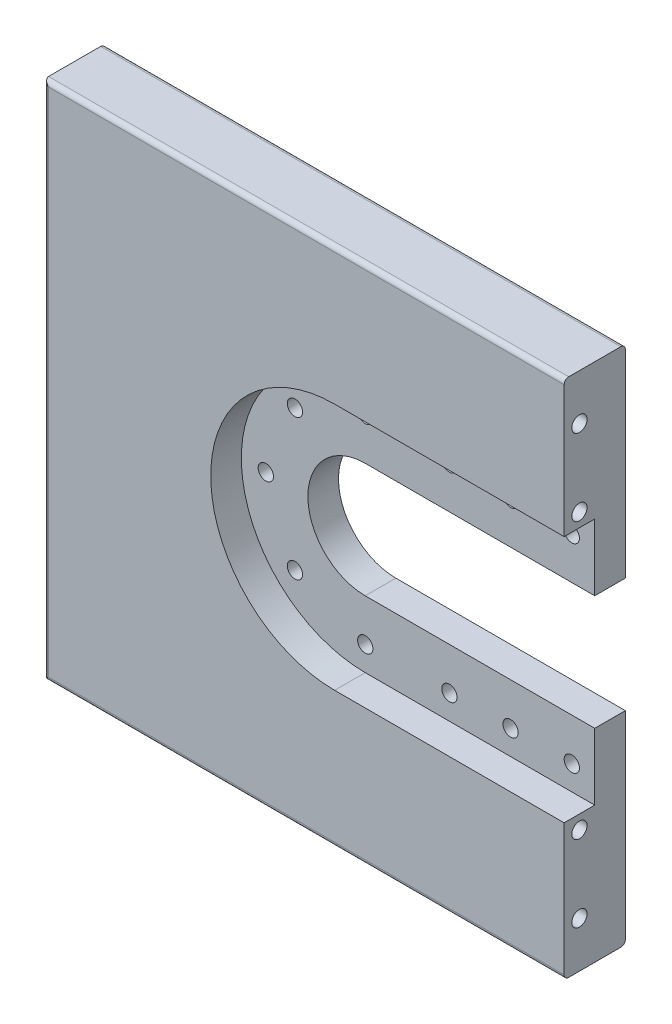
ISO-10303-21;
HEADER;
FILE_DESCRIPTION(('STEP AP214'),'2;1');
FILE_NAME('part.step','',(''),(''),'','','');
FILE_SCHEMA(('AUTOMOTIVE_DESIGN { 1 0 10303 214 1 1 1 1 }'));
ENDSEC;
DATA;
#1=APPLICATION_CONTEXT('core data for automotive mechanical design processes');
#2=APPLICATION_PROTOCOL_DEFINITION('international standard','automotive_design',2000,#1);
#3=PRODUCT_CONTEXT('',#1,'mechanical');
#4=PRODUCT('Part','Part','',(#3));
#5=PRODUCT_RELATED_PRODUCT_CATEGORY('part','',(#4));
#6=PRODUCT_DEFINITION_FORMATION('','',#4);
#7=PRODUCT_DEFINITION_CONTEXT('part definition',#1,'design');
#8=PRODUCT_DEFINITION('design','',#6,#7);
#9=PRODUCT_DEFINITION_SHAPE('','',#8);
#10=(LENGTH_UNIT() NAMED_UNIT(*) SI_UNIT(.MILLI.,.METRE.));
#11=(NAMED_UNIT(*) PLANE_ANGLE_UNIT() SI_UNIT($,.RADIAN.));
#12=(NAMED_UNIT(*) SI_UNIT($,.STERADIAN.) SOLID_ANGLE_UNIT());
#13=UNCERTAINTY_MEASURE_WITH_UNIT(LENGTH_MEASURE(1.E-05),#10,'distance_accuracy_value','');
#14=(GEOMETRIC_REPRESENTATION_CONTEXT(3) GLOBAL_UNCERTAINTY_ASSIGNED_CONTEXT((#13)) GLOBAL_UNIT_ASSIGNED_CONTEXT((#10,
#11,#12)) REPRESENTATION_CONTEXT('',''));
#15=CARTESIAN_POINT('',(0.,0.,0.));
#16=DIRECTION('',(0.,0.,1.));
#17=DIRECTION('',(1.,0.,0.));
#18=AXIS2_PLACEMENT_3D('',#15,#16,#17);
#19=CARTESIAN_POINT('',(170.,340.,-40.));
#20=DIRECTION('',(1.,0.,0.));
#21=DIRECTION('',(0.,1.,0.));
#22=AXIS2_PLACEMENT_3D('',#19,#20,#21);
#23=PLANE('',#22);
#24=CARTESIAN_POINT('',(170.,30.0000000000001,-10.0000000000024));
#25=DIRECTION('',(1.,0.,0.));
#26=DIRECTION('',(0.,1.,0.));
#27=AXIS2_PLACEMENT_3D('',#24,#25,#26);
#28=CIRCLE('',#27,5.);
#29=CARTESIAN_POINT('',(170.,35.0000000000001,-10.0000000000024));
#30=VERTEX_POINT('',#29);
#31=EDGE_CURVE('E599',#30,#30,#28,.T.);
#32=ORIENTED_EDGE('',*,*,#31,.F.);
#33=EDGE_LOOP('',(#32));
#34=FACE_BOUND('',#33,.T.);
#35=CARTESIAN_POINT('',(170.,80.0000000000001,-10.0000000000022));
#36=DIRECTION('',(1.,0.,0.));
#37=DIRECTION('',(0.,1.,0.));
#38=AXIS2_PLACEMENT_3D('',#35,#36,#37);
#39=CIRCLE('',#38,5.);
#40=CARTESIAN_POINT('',(170.,85.0000000000001,-10.0000000000022));
#41=VERTEX_POINT('',#40);
#42=EDGE_CURVE('E583',#41,#41,#39,.T.);
#43=ORIENTED_EDGE('',*,*,#42,.F.);
#44=EDGE_LOOP('',(#43));
#45=FACE_BOUND('',#44,.T.);
#46=DIRECTION('',(0.,1.,0.));
#47=VECTOR('',#46,1.);
#48=CARTESIAN_POINT('',(170.,340.,0.));
#49=LINE('',#48,#47);
#50=CARTESIAN_POINT('',(170.,3.,0.));
#51=VERTEX_POINT('',#50);
#52=CARTESIAN_POINT('',(170.,89.,0.));
#53=VERTEX_POINT('',#52);
#54=EDGE_CURVE('E244',#51,#53,#49,.T.);
#55=ORIENTED_EDGE('',*,*,#54,.F.);
#56=CARTESIAN_POINT('',(170.,3.,-3.));
#57=DIRECTION('',(1.,0.,0.));
#58=DIRECTION('',(0.,1.,0.));
#59=AXIS2_PLACEMENT_3D('',#56,#57,#58);
#60=CIRCLE('',#59,3.);
#61=CARTESIAN_POINT('',(170.,0.,-3.));
#62=VERTEX_POINT('',#61);
#63=EDGE_CURVE('E345',#51,#62,#60,.T.);
#64=ORIENTED_EDGE('',*,*,#63,.T.);
#65=DIRECTION('',(0.,0.,1.));
#66=VECTOR('',#65,1.);
#67=CARTESIAN_POINT('',(170.,0.,-40.));
#68=LINE('',#67,#66);
#69=CARTESIAN_POINT('',(170.,0.,-37.));
#70=VERTEX_POINT('',#69);
#71=EDGE_CURVE('E254',#70,#62,#68,.T.);
#72=ORIENTED_EDGE('',*,*,#71,.F.);
#73=CARTESIAN_POINT('',(170.,3.,-37.));
#74=DIRECTION('',(1.,0.,0.));
#75=DIRECTION('',(0.,1.,0.));
#76=AXIS2_PLACEMENT_3D('',#73,#74,#75);
#77=CIRCLE('',#76,3.);
#78=CARTESIAN_POINT('',(170.,3.,-40.));
#79=VERTEX_POINT('',#78);
#80=EDGE_CURVE('E342',#70,#79,#77,.T.);
#81=ORIENTED_EDGE('',*,*,#80,.T.);
#82=DIRECTION('',(0.,1.,0.));
#83=VECTOR('',#82,1.);
#84=CARTESIAN_POINT('',(170.,340.,-40.));
#85=LINE('',#84,#83);
#86=CARTESIAN_POINT('',(170.,132.5,-39.9999999999999));
#87=VERTEX_POINT('',#86);
#88=EDGE_CURVE('E240',#79,#87,#85,.T.);
#89=ORIENTED_EDGE('',*,*,#88,.T.);
#90=DIRECTION('',(0.,0.,-1.));
#91=VECTOR('',#90,1.);
#92=CARTESIAN_POINT('',(170.,132.5,100.));
#93=LINE('',#92,#91);
#94=CARTESIAN_POINT('',(170.,132.5,-20.));
#95=VERTEX_POINT('',#94);
#96=EDGE_CURVE('E166',#95,#87,#93,.T.);
#97=ORIENTED_EDGE('',*,*,#96,.F.);
#98=DIRECTION('',(0.,1.,0.));
#99=VECTOR('',#98,1.);
#100=CARTESIAN_POINT('',(170.,0.,-20.));
#101=LINE('',#100,#99);
#102=CARTESIAN_POINT('',(170.,89.,-20.));
#103=VERTEX_POINT('',#102);
#104=EDGE_CURVE('E209',#103,#95,#101,.T.);
#105=ORIENTED_EDGE('',*,*,#104,.F.);
#106=DIRECTION('',(0.,0.,1.));
#107=VECTOR('',#106,1.);
#108=CARTESIAN_POINT('',(170.,89.,-20.));
#109=LINE('',#108,#107);
#110=EDGE_CURVE('E227',#103,#53,#109,.T.);
#111=ORIENTED_EDGE('',*,*,#110,.T.);
#112=EDGE_LOOP('',(#55,#64,#72,#81,#89,#97,#105,#111));
#113=FACE_BOUND('',#112,.T.);
#114=ADVANCED_FACE('F38',(#34,#45,#113),#23,.T.);
#115=CARTESIAN_POINT('',(170.,260.,-10.));
#116=DIRECTION('',(1.,0.,0.));
#117=DIRECTION('',(0.,1.,0.));
#118=AXIS2_PLACEMENT_3D('',#115,#116,#117);
#119=CIRCLE('',#118,5.);
#120=CARTESIAN_POINT('',(170.,265.,-10.));
#121=VERTEX_POINT('',#120);
#122=EDGE_CURVE('E589',#121,#121,#119,.T.);
#123=ORIENTED_EDGE('',*,*,#122,.F.);
#124=EDGE_LOOP('',(#123));
#125=FACE_BOUND('',#124,.T.);
#126=CARTESIAN_POINT('',(170.,310.,-9.99999999999983));
#127=DIRECTION('',(1.,0.,0.));
#128=DIRECTION('',(0.,1.,0.));
#129=AXIS2_PLACEMENT_3D('',#126,#127,#128);
#130=CIRCLE('',#129,5.);
#131=CARTESIAN_POINT('',(170.,315.,-9.99999999999983));
#132=VERTEX_POINT('',#131);
#133=EDGE_CURVE('E580',#132,#132,#130,.T.);
#134=ORIENTED_EDGE('',*,*,#133,.F.);
#135=EDGE_LOOP('',(#134));
#136=FACE_BOUND('',#135,.T.);
#137=CARTESIAN_POINT('',(170.,207.5,-39.9999999999999));
#138=VERTEX_POINT('',#137);
#139=CARTESIAN_POINT('',(170.,337.,-40.));
#140=VERTEX_POINT('',#139);
#141=EDGE_CURVE('E180',#138,#140,#85,.T.);
#142=ORIENTED_EDGE('',*,*,#141,.T.);
#143=CARTESIAN_POINT('',(170.,337.,-37.));
#144=DIRECTION('',(1.,0.,0.));
#145=DIRECTION('',(0.,1.,0.));
#146=AXIS2_PLACEMENT_3D('',#143,#144,#145);
#147=CIRCLE('',#146,3.);
#148=CARTESIAN_POINT('',(170.,340.,-37.));
#149=VERTEX_POINT('',#148);
#150=EDGE_CURVE('E11',#140,#149,#147,.T.);
#151=ORIENTED_EDGE('',*,*,#150,.T.);
#152=DIRECTION('',(0.,0.,1.));
#153=VECTOR('',#152,1.);
#154=CARTESIAN_POINT('',(170.,340.,-40.));
#155=LINE('',#154,#153);
#156=CARTESIAN_POINT('',(170.,340.,-3.));
#157=VERTEX_POINT('',#156);
#158=EDGE_CURVE('E251',#149,#157,#155,.T.);
#159=ORIENTED_EDGE('',*,*,#158,.T.);
#160=CARTESIAN_POINT('',(170.,337.,-3.));
#161=DIRECTION('',(1.,0.,0.));
#162=DIRECTION('',(0.,1.,0.));
#163=AXIS2_PLACEMENT_3D('',#160,#161,#162);
#164=CIRCLE('',#163,3.);
#165=CARTESIAN_POINT('',(170.,337.,0.));
#166=VERTEX_POINT('',#165);
#167=EDGE_CURVE('E48',#157,#166,#164,.T.);
#168=ORIENTED_EDGE('',*,*,#167,.T.);
#169=CARTESIAN_POINT('',(170.,251.,0.));
#170=VERTEX_POINT('',#169);
#171=EDGE_CURVE('E231',#170,#166,#49,.T.);
#172=ORIENTED_EDGE('',*,*,#171,.F.);
#173=DIRECTION('',(0.,0.,1.));
#174=VECTOR('',#173,1.);
#175=CARTESIAN_POINT('',(170.,251.,-20.));
#176=LINE('',#175,#174);
#177=CARTESIAN_POINT('',(170.,251.,-20.));
#178=VERTEX_POINT('',#177);
#179=EDGE_CURVE('E216',#178,#170,#176,.T.);
#180=ORIENTED_EDGE('',*,*,#179,.F.);
#181=DIRECTION('',(0.,-1.,0.));
#182=VECTOR('',#181,1.);
#183=CARTESIAN_POINT('',(170.,0.,-20.));
#184=LINE('',#183,#182);
#185=CARTESIAN_POINT('',(170.,207.5,-20.));
#186=VERTEX_POINT('',#185);
#187=EDGE_CURVE('E195',#178,#186,#184,.T.);
#188=ORIENTED_EDGE('',*,*,#187,.T.);
#189=DIRECTION('',(0.,0.,-1.));
#190=VECTOR('',#189,1.);
#191=CARTESIAN_POINT('',(170.,207.5,100.));
#192=LINE('',#191,#190);
#193=EDGE_CURVE('E175',#186,#138,#192,.T.);
#194=ORIENTED_EDGE('',*,*,#193,.T.);
#195=EDGE_LOOP('',(#142,#151,#159,#168,#172,#180,#188,#194));
#196=FACE_BOUND('',#195,.T.);
#197=ADVANCED_FACE('F384',(#125,#136,#196),#23,.T.);
#198=CARTESIAN_POINT('',(0.,0.,0.));
#199=DIRECTION('',(0.,0.,-1.));
#200=DIRECTION('',(-1.,0.,0.));
#201=AXIS2_PLACEMENT_3D('',#198,#199,#200);
#202=PLANE('',#201);
#203=DIRECTION('',(0.,-1.,0.));
#204=VECTOR('',#203,1.);
#205=CARTESIAN_POINT('',(-167.,0.,0.));
#206=LINE('',#205,#204);
#207=CARTESIAN_POINT('',(-167.,337.,0.));
#208=VERTEX_POINT('',#207);
#209=CARTESIAN_POINT('',(-167.,3.,0.));
#210=VERTEX_POINT('',#209);
#211=EDGE_CURVE('E335',#208,#210,#206,.T.);
#212=ORIENTED_EDGE('',*,*,#211,.T.);
#213=DIRECTION('',(1.,0.,0.));
#214=VECTOR('',#213,1.);
#215=CARTESIAN_POINT('',(170.,3.,0.));
#216=LINE('',#215,#214);
#217=EDGE_CURVE('E339',#210,#51,#216,.T.);
#218=ORIENTED_EDGE('',*,*,#217,.T.);
#219=ORIENTED_EDGE('',*,*,#54,.T.);
#220=DIRECTION('',(-1.,0.,0.));
#221=VECTOR('',#220,1.);
#222=CARTESIAN_POINT('',(0.,89.,0.));
#223=LINE('',#222,#221);
#224=CARTESIAN_POINT('',(20.,89.,0.));
#225=VERTEX_POINT('',#224);
#226=EDGE_CURVE('E192',#53,#225,#223,.T.);
#227=ORIENTED_EDGE('',*,*,#226,.T.);
#228=CARTESIAN_POINT('',(20.,170.,0.));
#229=DIRECTION('',(0.,0.,1.));
#230=DIRECTION('',(1.,0.,0.));
#231=AXIS2_PLACEMENT_3D('',#228,#229,#230);
#232=CIRCLE('',#231,81.0000000000001);
#233=CARTESIAN_POINT('',(20.,251.,0.));
#234=VERTEX_POINT('',#233);
#235=EDGE_CURVE('E220',#234,#225,#232,.T.);
#236=ORIENTED_EDGE('',*,*,#235,.F.);
#237=DIRECTION('',(1.,0.,0.));
#238=VECTOR('',#237,1.);
#239=CARTESIAN_POINT('',(0.,251.,0.));
#240=LINE('',#239,#238);
#241=EDGE_CURVE('E185',#234,#170,#240,.T.);
#242=ORIENTED_EDGE('',*,*,#241,.T.);
#243=ORIENTED_EDGE('',*,*,#171,.T.);
#244=DIRECTION('',(-1.,0.,0.));
#245=VECTOR('',#244,1.);
#246=CARTESIAN_POINT('',(-170.,337.,0.));
#247=LINE('',#246,#245);
#248=EDGE_CURVE('E332',#166,#208,#247,.T.);
#249=ORIENTED_EDGE('',*,*,#248,.T.);
#250=EDGE_LOOP('',(#212,#218,#219,#227,#236,#242,#243,#249));
#251=FACE_BOUND('',#250,.T.);
#252=ADVANCED_FACE('F387',(#251),#202,.F.);
#253=CARTESIAN_POINT('',(-170.,0.,-40.));
#254=DIRECTION('',(-1.,0.,0.));
#255=DIRECTION('',(0.,-1.,0.));
#256=AXIS2_PLACEMENT_3D('',#253,#254,#255);
#257=PLANE('',#256);
#258=DIRECTION('',(0.,0.,1.));
#259=VECTOR('',#258,1.);
#260=CARTESIAN_POINT('',(-170.,340.,-40.));
#261=LINE('',#260,#259);
#262=CARTESIAN_POINT('',(-170.,340.,-37.));
#263=VERTEX_POINT('',#262);
#264=CARTESIAN_POINT('',(-170.,340.,-3.));
#265=VERTEX_POINT('',#264);
#266=EDGE_CURVE('E247',#263,#265,#261,.T.);
#267=ORIENTED_EDGE('',*,*,#266,.F.);
#268=DIRECTION('',(0.,-1.,0.));
#269=VECTOR('',#268,1.);
#270=CARTESIAN_POINT('',(-170.,0.,-37.));
#271=LINE('',#270,#269);
#272=CARTESIAN_POINT('',(-170.,0.,-37.));
#273=VERTEX_POINT('',#272);
#274=EDGE_CURVE('E319',#263,#273,#271,.T.);
#275=ORIENTED_EDGE('',*,*,#274,.T.);
#276=DIRECTION('',(0.,0.,1.));
#277=VECTOR('',#276,1.);
#278=CARTESIAN_POINT('',(-170.,0.,-40.));
#279=LINE('',#278,#277);
#280=CARTESIAN_POINT('',(-170.,0.,-3.));
#281=VERTEX_POINT('',#280);
#282=EDGE_CURVE('E243',#273,#281,#279,.T.);
#283=ORIENTED_EDGE('',*,*,#282,.T.);
#284=DIRECTION('',(0.,-1.,0.));
#285=VECTOR('',#284,1.);
#286=CARTESIAN_POINT('',(-170.,340.,-3.));
#287=LINE('',#286,#285);
#288=EDGE_CURVE('E250',#281,#265,#287,.F.);
#289=ORIENTED_EDGE('',*,*,#288,.T.);
#290=EDGE_LOOP('',(#267,#275,#283,#289));
#291=FACE_BOUND('',#290,.T.);
#292=ADVANCED_FACE('F401',(#291),#257,.T.);
#293=CARTESIAN_POINT('',(-170.,340.,-40.));
#294=DIRECTION('',(0.,1.,0.));
#295=DIRECTION('',(-1.,0.,0.));
#296=AXIS2_PLACEMENT_3D('',#293,#294,#295);
#297=PLANE('',#296);
#298=ORIENTED_EDGE('',*,*,#158,.F.);
#299=DIRECTION('',(-1.,0.,0.));
#300=VECTOR('',#299,1.);
#301=CARTESIAN_POINT('',(-170.,340.,-37.));
#302=LINE('',#301,#300);
#303=EDGE_CURVE('E356',#149,#263,#302,.T.);
#304=ORIENTED_EDGE('',*,*,#303,.T.);
#305=ORIENTED_EDGE('',*,*,#266,.T.);
#306=DIRECTION('',(-1.,0.,0.));
#307=VECTOR('',#306,1.);
#308=CARTESIAN_POINT('',(170.,340.,-3.));
#309=LINE('',#308,#307);
#310=EDGE_CURVE('E56',#265,#157,#309,.F.);
#311=ORIENTED_EDGE('',*,*,#310,.T.);
#312=EDGE_LOOP('',(#298,#304,#305,#311));
#313=FACE_BOUND('',#312,.T.);
#314=ADVANCED_FACE('F399',(#313),#297,.T.);
#315=CARTESIAN_POINT('',(170.,0.,-40.));
#316=DIRECTION('',(0.,-1.,0.));
#317=DIRECTION('',(0.,0.,-1.));
#318=AXIS2_PLACEMENT_3D('',#315,#316,#317);
#319=PLANE('',#318);
#320=ORIENTED_EDGE('',*,*,#71,.T.);
#321=DIRECTION('',(1.,0.,0.));
#322=VECTOR('',#321,1.);
#323=CARTESIAN_POINT('',(-170.,0.,-3.));
#324=LINE('',#323,#322);
#325=EDGE_CURVE('E351',#62,#281,#324,.F.);
#326=ORIENTED_EDGE('',*,*,#325,.T.);
#327=ORIENTED_EDGE('',*,*,#282,.F.);
#328=DIRECTION('',(1.,0.,0.));
#329=VECTOR('',#328,1.);
#330=CARTESIAN_POINT('',(170.,0.,-37.));
#331=LINE('',#330,#329);
#332=EDGE_CURVE('E348',#273,#70,#331,.T.);
#333=ORIENTED_EDGE('',*,*,#332,.T.);
#334=EDGE_LOOP('',(#320,#326,#327,#333));
#335=FACE_BOUND('',#334,.T.);
#336=ADVANCED_FACE('F404',(#335),#319,.T.);
#337=CARTESIAN_POINT('',(0.,0.,-40.));
#338=DIRECTION('',(0.,0.,-1.));
#339=DIRECTION('',(-1.,0.,0.));
#340=AXIS2_PLACEMENT_3D('',#337,#338,#339);
#341=PLANE('',#340);
#342=CARTESIAN_POINT('',(75.0000000000014,105.,-40.));
#343=DIRECTION('',(0.,0.,-1.));
#344=DIRECTION('',(-1.,0.,0.));
#345=AXIS2_PLACEMENT_3D('',#342,#343,#344);
#346=CIRCLE('',#345,4.99999999999999);
#347=CARTESIAN_POINT('',(70.0000000000015,105.,-40.));
#348=VERTEX_POINT('',#347);
#349=EDGE_CURVE('E316',#348,#348,#346,.F.);
#350=ORIENTED_EDGE('',*,*,#349,.T.);
#351=EDGE_LOOP('',(#350));
#352=FACE_BOUND('',#351,.T.);
#353=CARTESIAN_POINT('',(20.0000000000015,105.,-40.));
#354=DIRECTION('',(0.,0.,-1.));
#355=DIRECTION('',(-1.,0.,0.));
#356=AXIS2_PLACEMENT_3D('',#353,#354,#355);
#357=CIRCLE('',#356,5.);
#358=CARTESIAN_POINT('',(15.0000000000015,105.,-40.));
#359=VERTEX_POINT('',#358);
#360=EDGE_CURVE('E311',#359,#359,#357,.F.);
#361=ORIENTED_EDGE('',*,*,#360,.T.);
#362=EDGE_LOOP('',(#361));
#363=FACE_BOUND('',#362,.T.);
#364=CARTESIAN_POINT('',(-25.9619407771253,124.038059222874,-40.));
#365=DIRECTION('',(0.,0.,-1.));
#366=DIRECTION('',(-1.,0.,0.));
#367=AXIS2_PLACEMENT_3D('',#364,#365,#366);
#368=CIRCLE('',#367,4.99999999998577);
#369=CARTESIAN_POINT('',(-30.9619407771111,124.038059222874,-40.));
#370=VERTEX_POINT('',#369);
#371=EDGE_CURVE('E306',#370,#370,#368,.F.);
#372=ORIENTED_EDGE('',*,*,#371,.T.);
#373=EDGE_LOOP('',(#372));
#374=FACE_BOUND('',#373,.T.);
#375=CARTESIAN_POINT('',(155.,235.,-40.));
#376=DIRECTION('',(0.,0.,-1.));
#377=DIRECTION('',(-1.,0.,0.));
#378=AXIS2_PLACEMENT_3D('',#375,#376,#377);
#379=CIRCLE('',#378,5.00000000000002);
#380=CARTESIAN_POINT('',(150.,235.,-40.));
#381=VERTEX_POINT('',#380);
#382=EDGE_CURVE('E301',#381,#381,#379,.F.);
#383=ORIENTED_EDGE('',*,*,#382,.T.);
#384=EDGE_LOOP('',(#383));
#385=FACE_BOUND('',#384,.T.);
#386=CARTESIAN_POINT('',(20.0000000000001,235.,-40.));
#387=DIRECTION('',(0.,0.,-1.));
#388=DIRECTION('',(-1.,0.,0.));
#389=AXIS2_PLACEMENT_3D('',#386,#387,#388);
#390=CIRCLE('',#389,5.);
#391=CARTESIAN_POINT('',(15.0000000000001,235.,-40.));
#392=VERTEX_POINT('',#391);
#393=EDGE_CURVE('E296',#392,#392,#390,.F.);
#394=ORIENTED_EDGE('',*,*,#393,.T.);
#395=EDGE_LOOP('',(#394));
#396=FACE_BOUND('',#395,.T.);
#397=CARTESIAN_POINT('',(75.0000000000001,235.,-40.));
#398=DIRECTION('',(0.,0.,-1.));
#399=DIRECTION('',(-1.,0.,0.));
#400=AXIS2_PLACEMENT_3D('',#397,#398,#399);
#401=CIRCLE('',#400,5.00000000000001);
#402=CARTESIAN_POINT('',(70.0000000000001,235.,-40.));
#403=VERTEX_POINT('',#402);
#404=EDGE_CURVE('E291',#403,#403,#401,.F.);
#405=ORIENTED_EDGE('',*,*,#404,.T.);
#406=EDGE_LOOP('',(#405));
#407=FACE_BOUND('',#406,.T.);
#408=CARTESIAN_POINT('',(-45.,170.,-40.));
#409=DIRECTION('',(0.,0.,-1.));
#410=DIRECTION('',(-1.,0.,0.));
#411=AXIS2_PLACEMENT_3D('',#408,#409,#410);
#412=CIRCLE('',#411,4.99999999999033);
#413=CARTESIAN_POINT('',(-49.9999999999903,170.,-40.));
#414=VERTEX_POINT('',#413);
#415=EDGE_CURVE('E286',#414,#414,#412,.F.);
#416=ORIENTED_EDGE('',*,*,#415,.T.);
#417=EDGE_LOOP('',(#416));
#418=FACE_BOUND('',#417,.T.);
#419=CARTESIAN_POINT('',(115.,235.,-40.));
#420=DIRECTION('',(0.,0.,-1.));
#421=DIRECTION('',(-1.,0.,0.));
#422=AXIS2_PLACEMENT_3D('',#419,#420,#421);
#423=CIRCLE('',#422,4.99999999999999);
#424=CARTESIAN_POINT('',(110.,235.,-40.));
#425=VERTEX_POINT('',#424);
#426=EDGE_CURVE('E281',#425,#425,#423,.F.);
#427=ORIENTED_EDGE('',*,*,#426,.T.);
#428=EDGE_LOOP('',(#427));
#429=FACE_BOUND('',#428,.T.);
#430=CARTESIAN_POINT('',(115.000000000001,105.,-40.));
#431=DIRECTION('',(0.,0.,-1.));
#432=DIRECTION('',(-1.,0.,0.));
#433=AXIS2_PLACEMENT_3D('',#430,#431,#432);
#434=CIRCLE('',#433,5.00000000000001);
#435=CARTESIAN_POINT('',(110.000000000001,105.,-40.));
#436=VERTEX_POINT('',#435);
#437=EDGE_CURVE('E276',#436,#436,#434,.F.);
#438=ORIENTED_EDGE('',*,*,#437,.T.);
#439=EDGE_LOOP('',(#438));
#440=FACE_BOUND('',#439,.T.);
#441=CARTESIAN_POINT('',(155.000000000001,105.,-40.));
#442=DIRECTION('',(0.,0.,-1.));
#443=DIRECTION('',(-1.,0.,0.));
#444=AXIS2_PLACEMENT_3D('',#441,#442,#443);
#445=CIRCLE('',#444,4.99999999999999);
#446=CARTESIAN_POINT('',(150.000000000001,105.,-40.));
#447=VERTEX_POINT('',#446);
#448=EDGE_CURVE('E271',#447,#447,#445,.F.);
#449=ORIENTED_EDGE('',*,*,#448,.T.);
#450=EDGE_LOOP('',(#449));
#451=FACE_BOUND('',#450,.T.);
#452=CARTESIAN_POINT('',(-25.9619407771257,215.961940777126,-40.));
#453=DIRECTION('',(0.,0.,-1.));
#454=DIRECTION('',(-1.,0.,0.));
#455=AXIS2_PLACEMENT_3D('',#452,#453,#454);
#456=CIRCLE('',#455,4.99999999999635);
#457=CARTESIAN_POINT('',(-30.9619407771221,215.961940777126,-40.));
#458=VERTEX_POINT('',#457);
#459=EDGE_CURVE('E265',#458,#458,#456,.F.);
#460=ORIENTED_EDGE('',*,*,#459,.T.);
#461=EDGE_LOOP('',(#460));
#462=FACE_BOUND('',#461,.T.);
#463=ORIENTED_EDGE('',*,*,#88,.F.);
#464=DIRECTION('',(1.,0.,0.));
#465=VECTOR('',#464,1.);
#466=CARTESIAN_POINT('',(0.,3.,-40.));
#467=LINE('',#466,#465);
#468=CARTESIAN_POINT('',(-167.,3.,-40.));
#469=VERTEX_POINT('',#468);
#470=EDGE_CURVE('E329',#79,#469,#467,.F.);
#471=ORIENTED_EDGE('',*,*,#470,.T.);
#472=DIRECTION('',(0.,-1.,0.));
#473=VECTOR('',#472,1.);
#474=CARTESIAN_POINT('',(-167.,0.,-40.));
#475=LINE('',#474,#473);
#476=CARTESIAN_POINT('',(-167.,337.,-40.));
#477=VERTEX_POINT('',#476);
#478=EDGE_CURVE('E326',#469,#477,#475,.F.);
#479=ORIENTED_EDGE('',*,*,#478,.T.);
#480=DIRECTION('',(-1.,0.,0.));
#481=VECTOR('',#480,1.);
#482=CARTESIAN_POINT('',(-1.10042693911376E-13,337.,-40.));
#483=LINE('',#482,#481);
#484=EDGE_CURVE('E323',#477,#140,#483,.F.);
#485=ORIENTED_EDGE('',*,*,#484,.T.);
#486=ORIENTED_EDGE('',*,*,#141,.F.);
#487=DIRECTION('',(-1.,0.,0.));
#488=VECTOR('',#487,1.);
#489=CARTESIAN_POINT('',(0.,207.5,-40.));
#490=LINE('',#489,#488);
#491=CARTESIAN_POINT('',(20.,207.5,-39.9999999999999));
#492=VERTEX_POINT('',#491);
#493=EDGE_CURVE('E165',#138,#492,#490,.T.);
#494=ORIENTED_EDGE('',*,*,#493,.T.);
#495=CARTESIAN_POINT('',(20.,170.,-40.));
#496=DIRECTION('',(0.,0.,-1.));
#497=DIRECTION('',(-1.,0.,0.));
#498=AXIS2_PLACEMENT_3D('',#495,#496,#497);
#499=CIRCLE('',#498,37.5);
#500=CARTESIAN_POINT('',(20.,132.5,-39.9999999999999));
#501=VERTEX_POINT('',#500);
#502=EDGE_CURVE('E154',#492,#501,#499,.F.);
#503=ORIENTED_EDGE('',*,*,#502,.T.);
#504=DIRECTION('',(1.,0.,0.));
#505=VECTOR('',#504,1.);
#506=CARTESIAN_POINT('',(0.,132.5,-40.));
#507=LINE('',#506,#505);
#508=EDGE_CURVE('E182',#501,#87,#507,.T.);
#509=ORIENTED_EDGE('',*,*,#508,.T.);
#510=EDGE_LOOP('',(#463,#471,#479,#485,#486,#494,#503,#509));
#511=FACE_BOUND('',#510,.T.);
#512=ADVANCED_FACE('F179',(#352,#363,#374,#385,#396,#407,#418,#429,#440,#451,#462,#511),#341,.T.);
#513=CARTESIAN_POINT('',(0.,89.,-20.));
#514=DIRECTION('',(0.,1.,0.));
#515=DIRECTION('',(-1.,0.,0.));
#516=AXIS2_PLACEMENT_3D('',#513,#514,#515);
#517=PLANE('',#516);
#518=ORIENTED_EDGE('',*,*,#226,.F.);
#519=ORIENTED_EDGE('',*,*,#110,.F.);
#520=DIRECTION('',(-1.,0.,0.));
#521=VECTOR('',#520,1.);
#522=CARTESIAN_POINT('',(0.,89.,-20.));
#523=LINE('',#522,#521);
#524=CARTESIAN_POINT('',(20.,89.,-20.));
#525=VERTEX_POINT('',#524);
#526=EDGE_CURVE('E206',#103,#525,#523,.T.);
#527=ORIENTED_EDGE('',*,*,#526,.T.);
#528=DIRECTION('',(0.,0.,1.));
#529=VECTOR('',#528,1.);
#530=CARTESIAN_POINT('',(20.,89.,-20.));
#531=LINE('',#530,#529);
#532=EDGE_CURVE('E232',#525,#225,#531,.T.);
#533=ORIENTED_EDGE('',*,*,#532,.T.);
#534=EDGE_LOOP('',(#518,#519,#527,#533));
#535=FACE_BOUND('',#534,.T.);
#536=ADVANCED_FACE('F418',(#535),#517,.T.);
#537=CARTESIAN_POINT('',(20.,170.,-20.));
#538=DIRECTION('',(0.,0.,1.));
#539=DIRECTION('',(1.,0.,0.));
#540=AXIS2_PLACEMENT_3D('',#537,#538,#539);
#541=CYLINDRICAL_SURFACE('',#540,81.0000000000001);
#542=ORIENTED_EDGE('',*,*,#235,.T.);
#543=ORIENTED_EDGE('',*,*,#532,.F.);
#544=CARTESIAN_POINT('',(20.,170.,-20.));
#545=DIRECTION('',(0.,0.,1.));
#546=DIRECTION('',(1.,0.,0.));
#547=AXIS2_PLACEMENT_3D('',#544,#545,#546);
#548=CIRCLE('',#547,81.0000000000001);
#549=CARTESIAN_POINT('',(20.,251.,-20.));
#550=VERTEX_POINT('',#549);
#551=EDGE_CURVE('E202',#550,#525,#548,.T.);
#552=ORIENTED_EDGE('',*,*,#551,.F.);
#553=DIRECTION('',(0.,0.,1.));
#554=VECTOR('',#553,1.);
#555=CARTESIAN_POINT('',(20.,251.,-20.));
#556=LINE('',#555,#554);
#557=EDGE_CURVE('E235',#550,#234,#556,.T.);
#558=ORIENTED_EDGE('',*,*,#557,.T.);
#559=EDGE_LOOP('',(#542,#543,#552,#558));
#560=FACE_BOUND('',#559,.T.);
#561=ADVANCED_FACE('F427',(#560),#541,.F.);
#562=CARTESIAN_POINT('',(0.,251.,-20.));
#563=DIRECTION('',(0.,-1.,0.));
#564=DIRECTION('',(0.,0.,-1.));
#565=AXIS2_PLACEMENT_3D('',#562,#563,#564);
#566=PLANE('',#565);
#567=ORIENTED_EDGE('',*,*,#241,.F.);
#568=ORIENTED_EDGE('',*,*,#557,.F.);
#569=DIRECTION('',(1.,0.,0.));
#570=VECTOR('',#569,1.);
#571=CARTESIAN_POINT('',(0.,251.,-20.));
#572=LINE('',#571,#570);
#573=EDGE_CURVE('E199',#550,#178,#572,.T.);
#574=ORIENTED_EDGE('',*,*,#573,.T.);
#575=ORIENTED_EDGE('',*,*,#179,.T.);
#576=EDGE_LOOP('',(#567,#568,#574,#575));
#577=FACE_BOUND('',#576,.T.);
#578=ADVANCED_FACE('F429',(#577),#566,.T.);
#579=CARTESIAN_POINT('',(0.,0.,-20.));
#580=DIRECTION('',(0.,0.,1.));
#581=DIRECTION('',(1.,0.,0.));
#582=AXIS2_PLACEMENT_3D('',#579,#580,#581);
#583=PLANE('',#582);
#584=CARTESIAN_POINT('',(75.0000000000014,105.,-20.));
#585=DIRECTION('',(0.,0.,1.));
#586=DIRECTION('',(1.,0.,0.));
#587=AXIS2_PLACEMENT_3D('',#584,#585,#586);
#588=CIRCLE('',#587,4.99999999999999);
#589=CARTESIAN_POINT('',(80.0000000000014,105.,-20.));
#590=VERTEX_POINT('',#589);
#591=EDGE_CURVE('E312',#590,#590,#588,.F.);
#592=ORIENTED_EDGE('',*,*,#591,.T.);
#593=EDGE_LOOP('',(#592));
#594=FACE_BOUND('',#593,.T.);
#595=CARTESIAN_POINT('',(20.0000000000015,105.,-20.));
#596=DIRECTION('',(0.,0.,1.));
#597=DIRECTION('',(1.,0.,0.));
#598=AXIS2_PLACEMENT_3D('',#595,#596,#597);
#599=CIRCLE('',#598,5.);
#600=CARTESIAN_POINT('',(25.0000000000015,105.,-20.));
#601=VERTEX_POINT('',#600);
#602=EDGE_CURVE('E307',#601,#601,#599,.F.);
#603=ORIENTED_EDGE('',*,*,#602,.T.);
#604=EDGE_LOOP('',(#603));
#605=FACE_BOUND('',#604,.T.);
#606=CARTESIAN_POINT('',(-25.9619407771253,124.038059222874,-20.));
#607=DIRECTION('',(0.,0.,1.));
#608=DIRECTION('',(1.,0.,0.));
#609=AXIS2_PLACEMENT_3D('',#606,#607,#608);
#610=CIRCLE('',#609,4.99999999998577);
#611=CARTESIAN_POINT('',(-20.9619407771395,124.038059222874,-20.));
#612=VERTEX_POINT('',#611);
#613=EDGE_CURVE('E302',#612,#612,#610,.F.);
#614=ORIENTED_EDGE('',*,*,#613,.T.);
#615=EDGE_LOOP('',(#614));
#616=FACE_BOUND('',#615,.T.);
#617=CARTESIAN_POINT('',(155.,235.,-20.));
#618=DIRECTION('',(0.,0.,1.));
#619=DIRECTION('',(1.,0.,0.));
#620=AXIS2_PLACEMENT_3D('',#617,#618,#619);
#621=CIRCLE('',#620,5.00000000000002);
#622=CARTESIAN_POINT('',(160.,235.,-20.));
#623=VERTEX_POINT('',#622);
#624=EDGE_CURVE('E297',#623,#623,#621,.F.);
#625=ORIENTED_EDGE('',*,*,#624,.T.);
#626=EDGE_LOOP('',(#625));
#627=FACE_BOUND('',#626,.T.);
#628=CARTESIAN_POINT('',(20.0000000000001,235.,-20.));
#629=DIRECTION('',(0.,0.,1.));
#630=DIRECTION('',(1.,0.,0.));
#631=AXIS2_PLACEMENT_3D('',#628,#629,#630);
#632=CIRCLE('',#631,5.);
#633=CARTESIAN_POINT('',(25.0000000000001,235.,-20.));
#634=VERTEX_POINT('',#633);
#635=EDGE_CURVE('E292',#634,#634,#632,.F.);
#636=ORIENTED_EDGE('',*,*,#635,.T.);
#637=EDGE_LOOP('',(#636));
#638=FACE_BOUND('',#637,.T.);
#639=CARTESIAN_POINT('',(75.0000000000001,235.,-20.));
#640=DIRECTION('',(0.,0.,1.));
#641=DIRECTION('',(1.,0.,0.));
#642=AXIS2_PLACEMENT_3D('',#639,#640,#641);
#643=CIRCLE('',#642,5.00000000000001);
#644=CARTESIAN_POINT('',(80.0000000000001,235.,-20.));
#645=VERTEX_POINT('',#644);
#646=EDGE_CURVE('E287',#645,#645,#643,.F.);
#647=ORIENTED_EDGE('',*,*,#646,.T.);
#648=EDGE_LOOP('',(#647));
#649=FACE_BOUND('',#648,.T.);
#650=CARTESIAN_POINT('',(-45.,170.,-20.));
#651=DIRECTION('',(0.,0.,1.));
#652=DIRECTION('',(1.,0.,0.));
#653=AXIS2_PLACEMENT_3D('',#650,#651,#652);
#654=CIRCLE('',#653,4.99999999999033);
#655=CARTESIAN_POINT('',(-40.0000000000097,170.,-20.));
#656=VERTEX_POINT('',#655);
#657=EDGE_CURVE('E282',#656,#656,#654,.F.);
#658=ORIENTED_EDGE('',*,*,#657,.T.);
#659=EDGE_LOOP('',(#658));
#660=FACE_BOUND('',#659,.T.);
#661=CARTESIAN_POINT('',(115.,235.,-20.));
#662=DIRECTION('',(0.,0.,1.));
#663=DIRECTION('',(1.,0.,0.));
#664=AXIS2_PLACEMENT_3D('',#661,#662,#663);
#665=CIRCLE('',#664,4.99999999999999);
#666=CARTESIAN_POINT('',(120.,235.,-20.));
#667=VERTEX_POINT('',#666);
#668=EDGE_CURVE('E277',#667,#667,#665,.F.);
#669=ORIENTED_EDGE('',*,*,#668,.T.);
#670=EDGE_LOOP('',(#669));
#671=FACE_BOUND('',#670,.T.);
#672=CARTESIAN_POINT('',(115.000000000001,105.,-20.));
#673=DIRECTION('',(0.,0.,1.));
#674=DIRECTION('',(1.,0.,0.));
#675=AXIS2_PLACEMENT_3D('',#672,#673,#674);
#676=CIRCLE('',#675,5.00000000000001);
#677=CARTESIAN_POINT('',(120.000000000001,105.,-20.));
#678=VERTEX_POINT('',#677);
#679=EDGE_CURVE('E272',#678,#678,#676,.F.);
#680=ORIENTED_EDGE('',*,*,#679,.T.);
#681=EDGE_LOOP('',(#680));
#682=FACE_BOUND('',#681,.T.);
#683=CARTESIAN_POINT('',(155.000000000001,105.,-20.));
#684=DIRECTION('',(0.,0.,1.));
#685=DIRECTION('',(1.,0.,0.));
#686=AXIS2_PLACEMENT_3D('',#683,#684,#685);
#687=CIRCLE('',#686,4.99999999999999);
#688=CARTESIAN_POINT('',(160.000000000001,105.,-20.));
#689=VERTEX_POINT('',#688);
#690=EDGE_CURVE('E267',#689,#689,#687,.F.);
#691=ORIENTED_EDGE('',*,*,#690,.T.);
#692=EDGE_LOOP('',(#691));
#693=FACE_BOUND('',#692,.T.);
#694=CARTESIAN_POINT('',(-25.9619407771257,215.961940777126,-20.));
#695=DIRECTION('',(0.,0.,1.));
#696=DIRECTION('',(1.,0.,0.));
#697=AXIS2_PLACEMENT_3D('',#694,#695,#696);
#698=CIRCLE('',#697,4.99999999999635);
#699=CARTESIAN_POINT('',(-20.9619407771294,215.961940777126,-20.));
#700=VERTEX_POINT('',#699);
#701=EDGE_CURVE('E261',#700,#700,#698,.F.);
#702=ORIENTED_EDGE('',*,*,#701,.T.);
#703=EDGE_LOOP('',(#702));
#704=FACE_BOUND('',#703,.T.);
#705=CARTESIAN_POINT('',(20.,170.,-20.));
#706=DIRECTION('',(0.,0.,1.));
#707=DIRECTION('',(1.,0.,0.));
#708=AXIS2_PLACEMENT_3D('',#705,#706,#707);
#709=CIRCLE('',#708,37.5);
#710=CARTESIAN_POINT('',(20.,207.5,-20.));
#711=VERTEX_POINT('',#710);
#712=CARTESIAN_POINT('',(20.,132.5,-20.));
#713=VERTEX_POINT('',#712);
#714=EDGE_CURVE('E189',#711,#713,#709,.T.);
#715=ORIENTED_EDGE('',*,*,#714,.F.);
#716=DIRECTION('',(1.,0.,0.));
#717=VECTOR('',#716,1.);
#718=CARTESIAN_POINT('',(0.,207.5,-20.));
#719=LINE('',#718,#717);
#720=EDGE_CURVE('E172',#711,#186,#719,.T.);
#721=ORIENTED_EDGE('',*,*,#720,.T.);
#722=ORIENTED_EDGE('',*,*,#187,.F.);
#723=ORIENTED_EDGE('',*,*,#573,.F.);
#724=ORIENTED_EDGE('',*,*,#551,.T.);
#725=ORIENTED_EDGE('',*,*,#526,.F.);
#726=ORIENTED_EDGE('',*,*,#104,.T.);
#727=DIRECTION('',(1.,0.,0.));
#728=VECTOR('',#727,1.);
#729=CARTESIAN_POINT('',(0.,132.5,-20.));
#730=LINE('',#729,#728);
#731=EDGE_CURVE('E213',#713,#95,#730,.T.);
#732=ORIENTED_EDGE('',*,*,#731,.F.);
#733=EDGE_LOOP('',(#715,#721,#722,#723,#724,#725,#726,#732));
#734=FACE_BOUND('',#733,.T.);
#735=ADVANCED_FACE('F421',(#594,#605,#616,#627,#638,#649,#660,#671,#682,#693,#704,#734),#583,.T.);
#736=CARTESIAN_POINT('',(20.,132.5,100.));
#737=DIRECTION('',(0.,1.,0.));
#738=DIRECTION('',(0.,0.,1.));
#739=AXIS2_PLACEMENT_3D('',#736,#737,#738);
#740=PLANE('',#739);
#741=DIRECTION('',(0.,0.,-1.));
#742=VECTOR('',#741,1.);
#743=CARTESIAN_POINT('',(20.,132.5,100.));
#744=LINE('',#743,#742);
#745=EDGE_CURVE('E160',#713,#501,#744,.T.);
#746=ORIENTED_EDGE('',*,*,#745,.F.);
#747=ORIENTED_EDGE('',*,*,#731,.T.);
#748=ORIENTED_EDGE('',*,*,#96,.T.);
#749=ORIENTED_EDGE('',*,*,#508,.F.);
#750=EDGE_LOOP('',(#746,#747,#748,#749));
#751=FACE_BOUND('',#750,.T.);
#752=ADVANCED_FACE('F431',(#751),#740,.T.);
#753=CARTESIAN_POINT('',(20.,207.5,100.));
#754=DIRECTION('',(0.,-1.,0.));
#755=DIRECTION('',(0.,0.,-1.));
#756=AXIS2_PLACEMENT_3D('',#753,#754,#755);
#757=PLANE('',#756);
#758=ORIENTED_EDGE('',*,*,#193,.F.);
#759=ORIENTED_EDGE('',*,*,#720,.F.);
#760=DIRECTION('',(0.,0.,-1.));
#761=VECTOR('',#760,1.);
#762=CARTESIAN_POINT('',(20.,207.5,100.));
#763=LINE('',#762,#761);
#764=EDGE_CURVE('E157',#711,#492,#763,.T.);
#765=ORIENTED_EDGE('',*,*,#764,.T.);
#766=ORIENTED_EDGE('',*,*,#493,.F.);
#767=EDGE_LOOP('',(#758,#759,#765,#766));
#768=FACE_BOUND('',#767,.T.);
#769=ADVANCED_FACE('F169',(#768),#757,.T.);
#770=CARTESIAN_POINT('',(20.,170.,100.));
#771=DIRECTION('',(0.,0.,-1.));
#772=DIRECTION('',(-1.,0.,0.));
#773=AXIS2_PLACEMENT_3D('',#770,#771,#772);
#774=CYLINDRICAL_SURFACE('',#773,37.5);
#775=ORIENTED_EDGE('',*,*,#764,.F.);
#776=ORIENTED_EDGE('',*,*,#714,.T.);
#777=ORIENTED_EDGE('',*,*,#745,.T.);
#778=ORIENTED_EDGE('',*,*,#502,.F.);
#779=EDGE_LOOP('',(#775,#776,#777,#778));
#780=FACE_BOUND('',#779,.T.);
#781=ADVANCED_FACE('F156',(#780),#774,.F.);
#782=CARTESIAN_POINT('',(-25.9619407771257,215.961940777126,363.));
#783=DIRECTION('',(0.,0.,-1.));
#784=DIRECTION('',(-1.,0.,0.));
#785=AXIS2_PLACEMENT_3D('',#782,#783,#784);
#786=CYLINDRICAL_SURFACE('',#785,4.99999999999635);
#787=ORIENTED_EDGE('',*,*,#459,.F.);
#788=EDGE_LOOP('',(#787));
#789=FACE_BOUND('',#788,.T.);
#790=ORIENTED_EDGE('',*,*,#701,.F.);
#791=EDGE_LOOP('',(#790));
#792=FACE_BOUND('',#791,.T.);
#793=ADVANCED_FACE('F497',(#789,#792),#786,.F.);
#794=CARTESIAN_POINT('',(155.000000000001,105.,363.));
#795=DIRECTION('',(0.,0.,-1.));
#796=DIRECTION('',(-1.,0.,0.));
#797=AXIS2_PLACEMENT_3D('',#794,#795,#796);
#798=CYLINDRICAL_SURFACE('',#797,4.99999999999999);
#799=ORIENTED_EDGE('',*,*,#448,.F.);
#800=EDGE_LOOP('',(#799));
#801=FACE_BOUND('',#800,.T.);
#802=ORIENTED_EDGE('',*,*,#690,.F.);
#803=EDGE_LOOP('',(#802));
#804=FACE_BOUND('',#803,.T.);
#805=ADVANCED_FACE('F500',(#801,#804),#798,.F.);
#806=CARTESIAN_POINT('',(115.000000000001,105.,363.));
#807=DIRECTION('',(0.,0.,-1.));
#808=DIRECTION('',(-1.,0.,0.));
#809=AXIS2_PLACEMENT_3D('',#806,#807,#808);
#810=CYLINDRICAL_SURFACE('',#809,5.00000000000001);
#811=ORIENTED_EDGE('',*,*,#437,.F.);
#812=EDGE_LOOP('',(#811));
#813=FACE_BOUND('',#812,.T.);
#814=ORIENTED_EDGE('',*,*,#679,.F.);
#815=EDGE_LOOP('',(#814));
#816=FACE_BOUND('',#815,.T.);
#817=ADVANCED_FACE('F515',(#813,#816),#810,.F.);
#818=CARTESIAN_POINT('',(115.,235.,363.));
#819=DIRECTION('',(0.,0.,-1.));
#820=DIRECTION('',(-1.,0.,0.));
#821=AXIS2_PLACEMENT_3D('',#818,#819,#820);
#822=CYLINDRICAL_SURFACE('',#821,4.99999999999999);
#823=ORIENTED_EDGE('',*,*,#426,.F.);
#824=EDGE_LOOP('',(#823));
#825=FACE_BOUND('',#824,.T.);
#826=ORIENTED_EDGE('',*,*,#668,.F.);
#827=EDGE_LOOP('',(#826));
#828=FACE_BOUND('',#827,.T.);
#829=ADVANCED_FACE('F512',(#825,#828),#822,.F.);
#830=CARTESIAN_POINT('',(-45.,170.,363.));
#831=DIRECTION('',(0.,0.,-1.));
#832=DIRECTION('',(-1.,0.,0.));
#833=AXIS2_PLACEMENT_3D('',#830,#831,#832);
#834=CYLINDRICAL_SURFACE('',#833,4.99999999999033);
#835=ORIENTED_EDGE('',*,*,#415,.F.);
#836=EDGE_LOOP('',(#835));
#837=FACE_BOUND('',#836,.T.);
#838=ORIENTED_EDGE('',*,*,#657,.F.);
#839=EDGE_LOOP('',(#838));
#840=FACE_BOUND('',#839,.T.);
#841=ADVANCED_FACE('F506',(#837,#840),#834,.F.);
#842=CARTESIAN_POINT('',(75.0000000000001,235.,363.));
#843=DIRECTION('',(0.,0.,-1.));
#844=DIRECTION('',(-1.,0.,0.));
#845=AXIS2_PLACEMENT_3D('',#842,#843,#844);
#846=CYLINDRICAL_SURFACE('',#845,5.00000000000001);
#847=ORIENTED_EDGE('',*,*,#404,.F.);
#848=EDGE_LOOP('',(#847));
#849=FACE_BOUND('',#848,.T.);
#850=ORIENTED_EDGE('',*,*,#646,.F.);
#851=EDGE_LOOP('',(#850));
#852=FACE_BOUND('',#851,.T.);
#853=ADVANCED_FACE('F502',(#849,#852),#846,.F.);
#854=CARTESIAN_POINT('',(20.0000000000001,235.,363.));
#855=DIRECTION('',(0.,0.,-1.));
#856=DIRECTION('',(-1.,0.,0.));
#857=AXIS2_PLACEMENT_3D('',#854,#855,#856);
#858=CYLINDRICAL_SURFACE('',#857,5.);
#859=ORIENTED_EDGE('',*,*,#393,.F.);
#860=EDGE_LOOP('',(#859));
#861=FACE_BOUND('',#860,.T.);
#862=ORIENTED_EDGE('',*,*,#635,.F.);
#863=EDGE_LOOP('',(#862));
#864=FACE_BOUND('',#863,.T.);
#865=ADVANCED_FACE('F505',(#861,#864),#858,.F.);
#866=CARTESIAN_POINT('',(155.,235.,363.));
#867=DIRECTION('',(0.,0.,-1.));
#868=DIRECTION('',(-1.,0.,0.));
#869=AXIS2_PLACEMENT_3D('',#866,#867,#868);
#870=CYLINDRICAL_SURFACE('',#869,5.00000000000002);
#871=ORIENTED_EDGE('',*,*,#382,.F.);
#872=EDGE_LOOP('',(#871));
#873=FACE_BOUND('',#872,.T.);
#874=ORIENTED_EDGE('',*,*,#624,.F.);
#875=EDGE_LOOP('',(#874));
#876=FACE_BOUND('',#875,.T.);
#877=ADVANCED_FACE('F510',(#873,#876),#870,.F.);
#878=CARTESIAN_POINT('',(-25.9619407771253,124.038059222874,363.));
#879=DIRECTION('',(0.,0.,-1.));
#880=DIRECTION('',(-1.,0.,0.));
#881=AXIS2_PLACEMENT_3D('',#878,#879,#880);
#882=CYLINDRICAL_SURFACE('',#881,4.99999999998577);
#883=ORIENTED_EDGE('',*,*,#371,.F.);
#884=EDGE_LOOP('',(#883));
#885=FACE_BOUND('',#884,.T.);
#886=ORIENTED_EDGE('',*,*,#613,.F.);
#887=EDGE_LOOP('',(#886));
#888=FACE_BOUND('',#887,.T.);
#889=ADVANCED_FACE('F528',(#885,#888),#882,.F.);
#890=CARTESIAN_POINT('',(20.0000000000015,105.,363.));
#891=DIRECTION('',(0.,0.,-1.));
#892=DIRECTION('',(-1.,0.,0.));
#893=AXIS2_PLACEMENT_3D('',#890,#891,#892);
#894=CYLINDRICAL_SURFACE('',#893,5.);
#895=ORIENTED_EDGE('',*,*,#360,.F.);
#896=EDGE_LOOP('',(#895));
#897=FACE_BOUND('',#896,.T.);
#898=ORIENTED_EDGE('',*,*,#602,.F.);
#899=EDGE_LOOP('',(#898));
#900=FACE_BOUND('',#899,.T.);
#901=ADVANCED_FACE('F524',(#897,#900),#894,.F.);
#902=CARTESIAN_POINT('',(75.0000000000014,105.,363.));
#903=DIRECTION('',(0.,0.,-1.));
#904=DIRECTION('',(-1.,0.,0.));
#905=AXIS2_PLACEMENT_3D('',#902,#903,#904);
#906=CYLINDRICAL_SURFACE('',#905,4.99999999999999);
#907=ORIENTED_EDGE('',*,*,#349,.F.);
#908=EDGE_LOOP('',(#907));
#909=FACE_BOUND('',#908,.T.);
#910=ORIENTED_EDGE('',*,*,#591,.F.);
#911=EDGE_LOOP('',(#910));
#912=FACE_BOUND('',#911,.T.);
#913=ADVANCED_FACE('F520',(#909,#912),#906,.F.);
#914=CARTESIAN_POINT('',(152.,310.,-9.99999999999983));
#915=DIRECTION('',(1.,0.,0.));
#916=DIRECTION('',(0.,1.,0.));
#917=AXIS2_PLACEMENT_3D('',#914,#915,#916);
#918=CYLINDRICAL_SURFACE('',#917,5.);
#919=CARTESIAN_POINT('',(152.,310.,-9.99999999999983));
#920=DIRECTION('',(1.,0.,0.));
#921=DIRECTION('',(0.,1.,0.));
#922=AXIS2_PLACEMENT_3D('',#919,#920,#921);
#923=CIRCLE('',#922,5.);
#924=CARTESIAN_POINT('',(152.,315.,-9.99999999999983));
#925=VERTEX_POINT('',#924);
#926=EDGE_CURVE('E577',#925,#925,#923,.T.);
#927=ORIENTED_EDGE('',*,*,#926,.F.);
#928=EDGE_LOOP('',(#927));
#929=FACE_BOUND('',#928,.T.);
#930=ORIENTED_EDGE('',*,*,#133,.T.);
#931=EDGE_LOOP('',(#930));
#932=FACE_BOUND('',#931,.T.);
#933=ADVANCED_FACE('F523',(#929,#932),#918,.F.);
#934=CARTESIAN_POINT('',(152.,310.,-9.99999999999983));
#935=DIRECTION('',(1.,0.,0.));
#936=DIRECTION('',(0.,1.,0.));
#937=AXIS2_PLACEMENT_3D('',#934,#935,#936);
#938=PLANE('',#937);
#939=ORIENTED_EDGE('',*,*,#926,.T.);
#940=EDGE_LOOP('',(#939));
#941=FACE_BOUND('',#940,.T.);
#942=ADVANCED_FACE('F565',(#941),#938,.T.);
#943=CARTESIAN_POINT('',(152.,260.,-10.));
#944=DIRECTION('',(1.,0.,0.));
#945=DIRECTION('',(0.,1.,0.));
#946=AXIS2_PLACEMENT_3D('',#943,#944,#945);
#947=CYLINDRICAL_SURFACE('',#946,5.);
#948=CARTESIAN_POINT('',(152.,260.,-10.));
#949=DIRECTION('',(1.,0.,0.));
#950=DIRECTION('',(0.,1.,0.));
#951=AXIS2_PLACEMENT_3D('',#948,#949,#950);
#952=CIRCLE('',#951,5.);
#953=CARTESIAN_POINT('',(152.,265.,-10.));
#954=VERTEX_POINT('',#953);
#955=EDGE_CURVE('E595',#954,#954,#952,.T.);
#956=ORIENTED_EDGE('',*,*,#955,.F.);
#957=EDGE_LOOP('',(#956));
#958=FACE_BOUND('',#957,.T.);
#959=ORIENTED_EDGE('',*,*,#122,.T.);
#960=EDGE_LOOP('',(#959));
#961=FACE_BOUND('',#960,.T.);
#962=ADVANCED_FACE('F561',(#958,#961),#947,.F.);
#963=CARTESIAN_POINT('',(152.,260.,-10.));
#964=DIRECTION('',(1.,0.,0.));
#965=DIRECTION('',(0.,1.,0.));
#966=AXIS2_PLACEMENT_3D('',#963,#964,#965);
#967=PLANE('',#966);
#968=ORIENTED_EDGE('',*,*,#955,.T.);
#969=EDGE_LOOP('',(#968));
#970=FACE_BOUND('',#969,.T.);
#971=ADVANCED_FACE('F546',(#970),#967,.T.);
#972=CARTESIAN_POINT('',(152.,80.0000000000001,-10.0000000000022));
#973=DIRECTION('',(1.,0.,0.));
#974=DIRECTION('',(0.,1.,0.));
#975=AXIS2_PLACEMENT_3D('',#972,#973,#974);
#976=CYLINDRICAL_SURFACE('',#975,5.);
#977=CARTESIAN_POINT('',(152.,80.0000000000001,-10.0000000000022));
#978=DIRECTION('',(1.,0.,0.));
#979=DIRECTION('',(0.,1.,0.));
#980=AXIS2_PLACEMENT_3D('',#977,#978,#979);
#981=CIRCLE('',#980,5.);
#982=CARTESIAN_POINT('',(152.,85.0000000000001,-10.0000000000022));
#983=VERTEX_POINT('',#982);
#984=EDGE_CURVE('E266',#983,#983,#981,.T.);
#985=ORIENTED_EDGE('',*,*,#984,.F.);
#986=EDGE_LOOP('',(#985));
#987=FACE_BOUND('',#986,.T.);
#988=ORIENTED_EDGE('',*,*,#42,.T.);
#989=EDGE_LOOP('',(#988));
#990=FACE_BOUND('',#989,.T.);
#991=ADVANCED_FACE('F542',(#987,#990),#976,.F.);
#992=CARTESIAN_POINT('',(152.,0.,0.));
#993=DIRECTION('',(1.,0.,0.));
#994=DIRECTION('',(0.,1.,0.));
#995=AXIS2_PLACEMENT_3D('',#992,#993,#994);
#996=PLANE('',#995);
#997=ORIENTED_EDGE('',*,*,#984,.T.);
#998=EDGE_LOOP('',(#997));
#999=FACE_BOUND('',#998,.T.);
#1000=ADVANCED_FACE('F545',(#999),#996,.T.);
#1001=CARTESIAN_POINT('',(152.,30.0000000000001,-10.0000000000024));
#1002=DIRECTION('',(1.,0.,0.));
#1003=DIRECTION('',(0.,1.,0.));
#1004=AXIS2_PLACEMENT_3D('',#1001,#1002,#1003);
#1005=CYLINDRICAL_SURFACE('',#1004,5.);
#1006=CARTESIAN_POINT('',(152.,30.0000000000001,-10.0000000000024));
#1007=DIRECTION('',(1.,0.,0.));
#1008=DIRECTION('',(0.,1.,0.));
#1009=AXIS2_PLACEMENT_3D('',#1006,#1007,#1008);
#1010=CIRCLE('',#1009,5.);
#1011=CARTESIAN_POINT('',(152.,35.0000000000001,-10.0000000000024));
#1012=VERTEX_POINT('',#1011);
#1013=EDGE_CURVE('E367',#1012,#1012,#1010,.T.);
#1014=ORIENTED_EDGE('',*,*,#1013,.F.);
#1015=EDGE_LOOP('',(#1014));
#1016=FACE_BOUND('',#1015,.T.);
#1017=ORIENTED_EDGE('',*,*,#31,.T.);
#1018=EDGE_LOOP('',(#1017));
#1019=FACE_BOUND('',#1018,.T.);
#1020=ADVANCED_FACE('F550',(#1016,#1019),#1005,.F.);
#1021=CARTESIAN_POINT('',(152.,30.0000000000001,-10.0000000000024));
#1022=DIRECTION('',(1.,0.,0.));
#1023=DIRECTION('',(0.,1.,0.));
#1024=AXIS2_PLACEMENT_3D('',#1021,#1022,#1023);
#1025=PLANE('',#1024);
#1026=ORIENTED_EDGE('',*,*,#1013,.T.);
#1027=EDGE_LOOP('',(#1026));
#1028=FACE_BOUND('',#1027,.T.);
#1029=ADVANCED_FACE('F552',(#1028),#1025,.T.);
#1030=CARTESIAN_POINT('',(-170.,337.,-37.));
#1031=DIRECTION('',(-1.,0.,0.));
#1032=DIRECTION('',(0.,-1.,0.));
#1033=AXIS2_PLACEMENT_3D('',#1030,#1031,#1032);
#1034=CYLINDRICAL_SURFACE('',#1033,3.);
#1035=ORIENTED_EDGE('',*,*,#150,.F.);
#1036=ORIENTED_EDGE('',*,*,#484,.F.);
#1037=CARTESIAN_POINT('',(-167.,337.,-37.));
#1038=DIRECTION('',(-0.707106781186547,-0.707106781186548,0.));
#1039=DIRECTION('',(-0.707106781186548,0.707106781186547,0.));
#1040=AXIS2_PLACEMENT_3D('',#1037,#1038,#1039);
#1041=ELLIPSE('',#1040,4.24264068711928,3.);
#1042=EDGE_CURVE('E364',#263,#477,#1041,.T.);
#1043=ORIENTED_EDGE('',*,*,#1042,.F.);
#1044=ORIENTED_EDGE('',*,*,#303,.F.);
#1045=EDGE_LOOP('',(#1035,#1036,#1043,#1044));
#1046=FACE_BOUND('',#1045,.T.);
#1047=ADVANCED_FACE('F395',(#1046),#1034,.T.);
#1048=CARTESIAN_POINT('',(170.,3.,-37.));
#1049=DIRECTION('',(1.,0.,0.));
#1050=DIRECTION('',(0.,0.,-1.));
#1051=AXIS2_PLACEMENT_3D('',#1048,#1049,#1050);
#1052=CYLINDRICAL_SURFACE('',#1051,3.);
#1053=ORIENTED_EDGE('',*,*,#80,.F.);
#1054=ORIENTED_EDGE('',*,*,#332,.F.);
#1055=CARTESIAN_POINT('',(-167.,3.,-37.));
#1056=DIRECTION('',(0.707106781186548,-0.707106781186547,0.));
#1057=DIRECTION('',(0.707106781186547,0.707106781186548,0.));
#1058=AXIS2_PLACEMENT_3D('',#1055,#1056,#1057);
#1059=ELLIPSE('',#1058,4.24264068711928,3.);
#1060=EDGE_CURVE('E361',#469,#273,#1059,.F.);
#1061=ORIENTED_EDGE('',*,*,#1060,.F.);
#1062=ORIENTED_EDGE('',*,*,#470,.F.);
#1063=EDGE_LOOP('',(#1053,#1054,#1061,#1062));
#1064=FACE_BOUND('',#1063,.T.);
#1065=ADVANCED_FACE('F447',(#1064),#1052,.T.);
#1066=CARTESIAN_POINT('',(-167.,0.,-37.));
#1067=DIRECTION('',(0.,-1.,0.));
#1068=DIRECTION('',(1.,0.,0.));
#1069=AXIS2_PLACEMENT_3D('',#1066,#1067,#1068);
#1070=CYLINDRICAL_SURFACE('',#1069,3.);
#1071=ORIENTED_EDGE('',*,*,#1042,.T.);
#1072=ORIENTED_EDGE('',*,*,#478,.F.);
#1073=ORIENTED_EDGE('',*,*,#1060,.T.);
#1074=ORIENTED_EDGE('',*,*,#274,.F.);
#1075=EDGE_LOOP('',(#1071,#1072,#1073,#1074));
#1076=FACE_BOUND('',#1075,.T.);
#1077=ADVANCED_FACE('F449',(#1076),#1070,.T.);
#1078=CARTESIAN_POINT('',(-1.10042693911376E-13,337.,-3.));
#1079=DIRECTION('',(1.,0.,0.));
#1080=DIRECTION('',(0.,1.,0.));
#1081=AXIS2_PLACEMENT_3D('',#1078,#1079,#1080);
#1082=CYLINDRICAL_SURFACE('',#1081,3.);
#1083=ORIENTED_EDGE('',*,*,#167,.F.);
#1084=ORIENTED_EDGE('',*,*,#310,.F.);
#1085=CARTESIAN_POINT('',(-167.,337.,-3.));
#1086=DIRECTION('',(0.707106781186547,0.707106781186548,0.));
#1087=DIRECTION('',(0.707106781186548,-0.707106781186547,0.));
#1088=AXIS2_PLACEMENT_3D('',#1085,#1086,#1087);
#1089=ELLIPSE('',#1088,4.24264068711928,3.);
#1090=EDGE_CURVE('E42',#208,#265,#1089,.F.);
#1091=ORIENTED_EDGE('',*,*,#1090,.F.);
#1092=ORIENTED_EDGE('',*,*,#248,.F.);
#1093=EDGE_LOOP('',(#1083,#1084,#1091,#1092));
#1094=FACE_BOUND('',#1093,.T.);
#1095=ADVANCED_FACE('F40',(#1094),#1082,.T.);
#1096=CARTESIAN_POINT('',(0.,3.,-3.));
#1097=DIRECTION('',(-1.,0.,0.));
#1098=DIRECTION('',(0.,0.,1.));
#1099=AXIS2_PLACEMENT_3D('',#1096,#1097,#1098);
#1100=CYLINDRICAL_SURFACE('',#1099,3.);
#1101=ORIENTED_EDGE('',*,*,#63,.F.);
#1102=ORIENTED_EDGE('',*,*,#217,.F.);
#1103=CARTESIAN_POINT('',(-167.,3.,-3.));
#1104=DIRECTION('',(-0.707106781186548,0.707106781186547,0.));
#1105=DIRECTION('',(-0.707106781186547,-0.707106781186548,0.));
#1106=AXIS2_PLACEMENT_3D('',#1103,#1104,#1105);
#1107=ELLIPSE('',#1106,4.24264068711928,3.);
#1108=EDGE_CURVE('E368',#281,#210,#1107,.T.);
#1109=ORIENTED_EDGE('',*,*,#1108,.F.);
#1110=ORIENTED_EDGE('',*,*,#325,.F.);
#1111=EDGE_LOOP('',(#1101,#1102,#1109,#1110));
#1112=FACE_BOUND('',#1111,.T.);
#1113=ADVANCED_FACE('F410',(#1112),#1100,.T.);
#1114=CARTESIAN_POINT('',(-167.,0.,-3.));
#1115=DIRECTION('',(0.,1.,0.));
#1116=DIRECTION('',(-1.,0.,0.));
#1117=AXIS2_PLACEMENT_3D('',#1114,#1115,#1116);
#1118=CYLINDRICAL_SURFACE('',#1117,3.);
#1119=ORIENTED_EDGE('',*,*,#1090,.T.);
#1120=ORIENTED_EDGE('',*,*,#288,.F.);
#1121=ORIENTED_EDGE('',*,*,#1108,.T.);
#1122=ORIENTED_EDGE('',*,*,#211,.F.);
#1123=EDGE_LOOP('',(#1119,#1120,#1121,#1122));
#1124=FACE_BOUND('',#1123,.T.);
#1125=ADVANCED_FACE('F378',(#1124),#1118,.T.);
#1126=CLOSED_SHELL('',(#114,#197,#252,#292,#314,#336,#512,#536,#561,#578,#735,#752,#769,#781,
#793,#805,#817,#829,#841,#853,#865,#877,#889,#901,#913,#933,#942,#962,#971,#991,#1000,#1020,
#1029,#1047,#1065,#1077,#1095,#1113,#1125));
#1127=MANIFOLD_SOLID_BREP('B2',#1126);
#1128=ADVANCED_BREP_SHAPE_REPRESENTATION('',(#18,#1127),#14);
#1129=SHAPE_DEFINITION_REPRESENTATION(#9,#1128);
ENDSEC;
END-ISO-10303-21;
